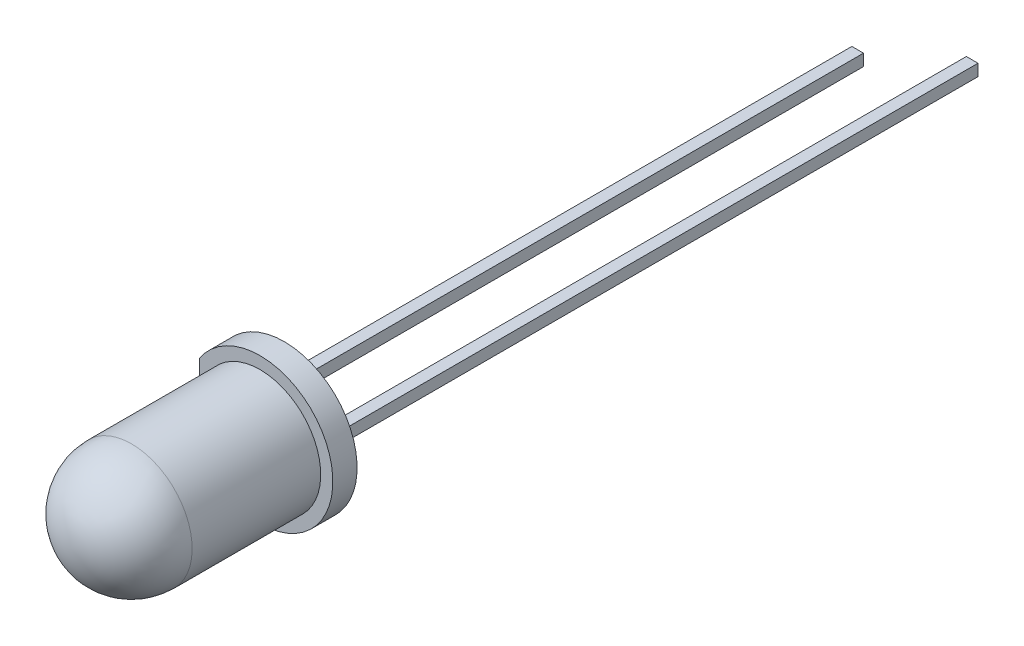
ISO-10303-21;
HEADER;
FILE_DESCRIPTION(('STEP AP214'),'2;1');
FILE_NAME('part.step','',(''),(''),'','','');
FILE_SCHEMA(('AUTOMOTIVE_DESIGN { 1 0 10303 214 1 1 1 1 }'));
ENDSEC;
DATA;
#1=APPLICATION_CONTEXT('core data for automotive mechanical design processes');
#2=APPLICATION_PROTOCOL_DEFINITION('international standard','automotive_design',2000,#1);
#3=PRODUCT_CONTEXT('',#1,'mechanical');
#4=PRODUCT('Part','Part','',(#3));
#5=PRODUCT_RELATED_PRODUCT_CATEGORY('part','',(#4));
#6=PRODUCT_DEFINITION_FORMATION('','',#4);
#7=PRODUCT_DEFINITION_CONTEXT('part definition',#1,'design');
#8=PRODUCT_DEFINITION('design','',#6,#7);
#9=PRODUCT_DEFINITION_SHAPE('','',#8);
#10=(LENGTH_UNIT() NAMED_UNIT(*) SI_UNIT(.MILLI.,.METRE.));
#11=(NAMED_UNIT(*) PLANE_ANGLE_UNIT() SI_UNIT($,.RADIAN.));
#12=(NAMED_UNIT(*) SI_UNIT($,.STERADIAN.) SOLID_ANGLE_UNIT());
#13=UNCERTAINTY_MEASURE_WITH_UNIT(LENGTH_MEASURE(1.E-05),#10,'distance_accuracy_value','');
#14=(GEOMETRIC_REPRESENTATION_CONTEXT(3) GLOBAL_UNCERTAINTY_ASSIGNED_CONTEXT((#13)) GLOBAL_UNIT_ASSIGNED_CONTEXT((#10,
#11,#12)) REPRESENTATION_CONTEXT('',''));
#15=CARTESIAN_POINT('',(0.,0.,0.));
#16=DIRECTION('',(0.,0.,1.));
#17=DIRECTION('',(1.,0.,0.));
#18=AXIS2_PLACEMENT_3D('',#15,#16,#17);
#19=CARTESIAN_POINT('',(-0.0499999999999997,0.,4.26666666666667));
#20=DIRECTION('',(0.,0.,1.));
#21=DIRECTION('',(-1.,0.,0.));
#22=AXIS2_PLACEMENT_3D('',#19,#20,#21);
#23=SPHERICAL_SURFACE('',#22,0.566666666666667);
#24=CARTESIAN_POINT('',(-0.0499999999999997,-0.24,4.26666666666667));
#25=DIRECTION('',(0.,1.,0.));
#26=DIRECTION('',(0.,0.,1.));
#27=AXIS2_PLACEMENT_3D('',#24,#25,#26);
#28=CIRCLE('',#27,0.513333333333333);
#29=CARTESIAN_POINT('',(-0.488634243989226,-0.24,4.));
#30=VERTEX_POINT('',#29);
#31=CARTESIAN_POINT('',(0.388634243989226,-0.24,4.));
#32=VERTEX_POINT('',#31);
#33=EDGE_CURVE('E166',#30,#32,#28,.F.);
#34=ORIENTED_EDGE('',*,*,#33,.T.);
#35=CARTESIAN_POINT('',(-0.0499999999999997,0.,4.));
#36=DIRECTION('',(0.,0.,1.));
#37=DIRECTION('',(1.,0.,0.));
#38=AXIS2_PLACEMENT_3D('',#35,#36,#37);
#39=CIRCLE('',#38,0.5);
#40=EDGE_CURVE('E61',#30,#32,#39,.T.);
#41=ORIENTED_EDGE('',*,*,#40,.F.);
#42=EDGE_LOOP('',(#34,#41));
#43=FACE_BOUND('',#42,.T.);
#44=ADVANCED_FACE('F53',(#43),#23,.T.);
#45=CARTESIAN_POINT('',(0.388634243989226,0.24,4.));
#46=VERTEX_POINT('',#45);
#47=CARTESIAN_POINT('',(-0.488634243989226,0.24,4.));
#48=VERTEX_POINT('',#47);
#49=EDGE_CURVE('E12',#46,#48,#39,.T.);
#50=ORIENTED_EDGE('',*,*,#49,.F.);
#51=CARTESIAN_POINT('',(-0.0499999999999997,0.24,4.26666666666667));
#52=DIRECTION('',(0.,1.,0.));
#53=DIRECTION('',(0.,0.,1.));
#54=AXIS2_PLACEMENT_3D('',#51,#52,#53);
#55=CIRCLE('',#54,0.513333333333333);
#56=EDGE_CURVE('E188',#48,#46,#55,.F.);
#57=ORIENTED_EDGE('',*,*,#56,.F.);
#58=EDGE_LOOP('',(#50,#57));
#59=FACE_BOUND('',#58,.T.);
#60=ADVANCED_FACE('F55',(#59),#23,.T.);
#61=CARTESIAN_POINT('',(-0.55,0.,4.));
#62=DIRECTION('',(0.,0.,-1.));
#63=DIRECTION('',(-1.,0.,0.));
#64=AXIS2_PLACEMENT_3D('',#61,#62,#63);
#65=PLANE('',#64);
#66=CARTESIAN_POINT('',(-0.0499999999999997,0.,4.));
#67=DIRECTION('',(0.,0.,1.));
#68=DIRECTION('',(1.,0.,0.));
#69=AXIS2_PLACEMENT_3D('',#66,#67,#68);
#70=CIRCLE('',#69,0.2);
#71=CARTESIAN_POINT('',(0.15,0.,4.));
#72=VERTEX_POINT('',#71);
#73=EDGE_CURVE('E261',#72,#72,#70,.T.);
#74=ORIENTED_EDGE('',*,*,#73,.F.);
#75=EDGE_LOOP('',(#74));
#76=FACE_BOUND('',#75,.T.);
#77=ORIENTED_EDGE('',*,*,#49,.T.);
#78=DIRECTION('',(1.,0.,0.));
#79=VECTOR('',#78,1.);
#80=CARTESIAN_POINT('',(-1.3,0.24,4.));
#81=LINE('',#80,#79);
#82=CARTESIAN_POINT('',(-1.3,0.24,4.));
#83=VERTEX_POINT('',#82);
#84=EDGE_CURVE('E107',#83,#48,#81,.T.);
#85=ORIENTED_EDGE('',*,*,#84,.F.);
#86=DIRECTION('',(0.,-1.,0.));
#87=VECTOR('',#86,1.);
#88=CARTESIAN_POINT('',(-1.3,0.24,4.));
#89=LINE('',#88,#87);
#90=CARTESIAN_POINT('',(-1.3,-0.24,4.));
#91=VERTEX_POINT('',#90);
#92=EDGE_CURVE('E165',#83,#91,#89,.T.);
#93=ORIENTED_EDGE('',*,*,#92,.T.);
#94=DIRECTION('',(1.,0.,0.));
#95=VECTOR('',#94,1.);
#96=CARTESIAN_POINT('',(-1.3,-0.24,4.));
#97=LINE('',#96,#95);
#98=EDGE_CURVE('E68',#91,#30,#97,.T.);
#99=ORIENTED_EDGE('',*,*,#98,.T.);
#100=ORIENTED_EDGE('',*,*,#40,.T.);
#101=CARTESIAN_POINT('',(1.2,-0.24,4.));
#102=VERTEX_POINT('',#101);
#103=EDGE_CURVE('E151',#32,#102,#97,.T.);
#104=ORIENTED_EDGE('',*,*,#103,.T.);
#105=DIRECTION('',(0.,-1.,0.));
#106=VECTOR('',#105,1.);
#107=CARTESIAN_POINT('',(1.2,0.24,4.));
#108=LINE('',#107,#106);
#109=CARTESIAN_POINT('',(1.2,0.24,4.));
#110=VERTEX_POINT('',#109);
#111=EDGE_CURVE('E135',#110,#102,#108,.T.);
#112=ORIENTED_EDGE('',*,*,#111,.F.);
#113=EDGE_CURVE('E123',#46,#110,#81,.T.);
#114=ORIENTED_EDGE('',*,*,#113,.F.);
#115=EDGE_LOOP('',(#77,#85,#93,#99,#100,#104,#112,#114));
#116=FACE_BOUND('',#115,.T.);
#117=ADVANCED_FACE('F171',(#76,#116),#65,.F.);
#118=CARTESIAN_POINT('',(0.,0.24,0.));
#119=DIRECTION('',(0.,1.,0.));
#120=DIRECTION('',(0.,0.,1.));
#121=AXIS2_PLACEMENT_3D('',#118,#119,#120);
#122=PLANE('',#121);
#123=ORIENTED_EDGE('',*,*,#84,.T.);
#124=ORIENTED_EDGE('',*,*,#56,.T.);
#125=ORIENTED_EDGE('',*,*,#113,.T.);
#126=DIRECTION('',(-0.508148861978286,0.,-0.861269257590315));
#127=VECTOR('',#126,1.);
#128=CARTESIAN_POINT('',(1.2,0.24,4.));
#129=LINE('',#128,#127);
#130=CARTESIAN_POINT('',(0.0199999999999998,0.24,2.));
#131=VERTEX_POINT('',#130);
#132=EDGE_CURVE('E114',#110,#131,#129,.T.);
#133=ORIENTED_EDGE('',*,*,#132,.T.);
#134=DIRECTION('',(-1.,0.,0.));
#135=VECTOR('',#134,1.);
#136=CARTESIAN_POINT('',(0.0199999999999998,0.24,2.));
#137=LINE('',#136,#135);
#138=CARTESIAN_POINT('',(-1.12,0.24,2.));
#139=VERTEX_POINT('',#138);
#140=EDGE_CURVE('E119',#131,#139,#137,.T.);
#141=ORIENTED_EDGE('',*,*,#140,.T.);
#142=DIRECTION('',(0.,0.,-1.));
#143=VECTOR('',#142,1.);
#144=CARTESIAN_POINT('',(-1.12,0.24,2.));
#145=LINE('',#144,#143);
#146=CARTESIAN_POINT('',(-1.12,0.24,-25.));
#147=VERTEX_POINT('',#146);
#148=EDGE_CURVE('E141',#139,#147,#145,.T.);
#149=ORIENTED_EDGE('',*,*,#148,.T.);
#150=DIRECTION('',(1.,0.,0.));
#151=VECTOR('',#150,1.);
#152=CARTESIAN_POINT('',(-1.12,0.24,-25.));
#153=LINE('',#152,#151);
#154=CARTESIAN_POINT('',(-1.6,0.24,-25.));
#155=VERTEX_POINT('',#154);
#156=EDGE_CURVE('E152',#155,#147,#153,.T.);
#157=ORIENTED_EDGE('',*,*,#156,.F.);
#158=DIRECTION('',(0.,0.,1.));
#159=VECTOR('',#158,1.);
#160=CARTESIAN_POINT('',(-1.6,0.24,0.));
#161=LINE('',#160,#159);
#162=CARTESIAN_POINT('',(-1.6,0.24,3.5));
#163=VERTEX_POINT('',#162);
#164=EDGE_CURVE('E77',#155,#163,#161,.T.);
#165=ORIENTED_EDGE('',*,*,#164,.T.);
#166=DIRECTION('',(0.514495755427526,0.,0.857492925712544));
#167=VECTOR('',#166,1.);
#168=CARTESIAN_POINT('',(-1.6,0.24,3.5));
#169=LINE('',#168,#167);
#170=EDGE_CURVE('E161',#163,#83,#169,.T.);
#171=ORIENTED_EDGE('',*,*,#170,.T.);
#172=EDGE_LOOP('',(#123,#124,#125,#133,#141,#149,#157,#165,#171));
#173=FACE_BOUND('',#172,.T.);
#174=ADVANCED_FACE('F116',(#173),#122,.T.);
#175=CARTESIAN_POINT('',(0.,-0.24,0.));
#176=DIRECTION('',(0.,1.,0.));
#177=DIRECTION('',(0.,0.,1.));
#178=AXIS2_PLACEMENT_3D('',#175,#176,#177);
#179=PLANE('',#178);
#180=ORIENTED_EDGE('',*,*,#33,.F.);
#181=ORIENTED_EDGE('',*,*,#98,.F.);
#182=DIRECTION('',(0.514495755427526,0.,0.857492925712544));
#183=VECTOR('',#182,1.);
#184=CARTESIAN_POINT('',(-1.6,-0.24,3.5));
#185=LINE('',#184,#183);
#186=CARTESIAN_POINT('',(-1.6,-0.24,3.5));
#187=VERTEX_POINT('',#186);
#188=EDGE_CURVE('E148',#187,#91,#185,.T.);
#189=ORIENTED_EDGE('',*,*,#188,.F.);
#190=DIRECTION('',(0.,0.,1.));
#191=VECTOR('',#190,1.);
#192=CARTESIAN_POINT('',(-1.6,-0.24,0.));
#193=LINE('',#192,#191);
#194=CARTESIAN_POINT('',(-1.6,-0.24,-25.));
#195=VERTEX_POINT('',#194);
#196=EDGE_CURVE('E101',#195,#187,#193,.T.);
#197=ORIENTED_EDGE('',*,*,#196,.F.);
#198=DIRECTION('',(-1.,0.,0.));
#199=VECTOR('',#198,1.);
#200=CARTESIAN_POINT('',(-1.12,-0.24,-25.));
#201=LINE('',#200,#199);
#202=CARTESIAN_POINT('',(-1.12,-0.24,-25.));
#203=VERTEX_POINT('',#202);
#204=EDGE_CURVE('E209',#203,#195,#201,.T.);
#205=ORIENTED_EDGE('',*,*,#204,.F.);
#206=DIRECTION('',(0.,0.,-1.));
#207=VECTOR('',#206,1.);
#208=CARTESIAN_POINT('',(-1.12,-0.24,2.));
#209=LINE('',#208,#207);
#210=CARTESIAN_POINT('',(-1.12,-0.24,2.));
#211=VERTEX_POINT('',#210);
#212=EDGE_CURVE('E157',#211,#203,#209,.T.);
#213=ORIENTED_EDGE('',*,*,#212,.F.);
#214=DIRECTION('',(-1.,0.,0.));
#215=VECTOR('',#214,1.);
#216=CARTESIAN_POINT('',(0.0199999999999998,-0.24,2.));
#217=LINE('',#216,#215);
#218=CARTESIAN_POINT('',(0.0199999999999998,-0.24,2.));
#219=VERTEX_POINT('',#218);
#220=EDGE_CURVE('E155',#219,#211,#217,.T.);
#221=ORIENTED_EDGE('',*,*,#220,.F.);
#222=DIRECTION('',(-0.508148861978286,0.,-0.861269257590315));
#223=VECTOR('',#222,1.);
#224=CARTESIAN_POINT('',(1.2,-0.24,4.));
#225=LINE('',#224,#223);
#226=EDGE_CURVE('E132',#102,#219,#225,.T.);
#227=ORIENTED_EDGE('',*,*,#226,.F.);
#228=ORIENTED_EDGE('',*,*,#103,.F.);
#229=EDGE_LOOP('',(#180,#181,#189,#197,#205,#213,#221,#227,#228));
#230=FACE_BOUND('',#229,.T.);
#231=ADVANCED_FACE('F223',(#230),#179,.F.);
#232=CARTESIAN_POINT('',(-1.6,0.24,3.5));
#233=DIRECTION('',(0.857492925712544,0.,-0.514495755427526));
#234=DIRECTION('',(-0.514495755427526,0.,-0.857492925712544));
#235=AXIS2_PLACEMENT_3D('',#232,#233,#234);
#236=PLANE('',#235);
#237=ORIENTED_EDGE('',*,*,#188,.T.);
#238=ORIENTED_EDGE('',*,*,#92,.F.);
#239=ORIENTED_EDGE('',*,*,#170,.F.);
#240=DIRECTION('',(0.,-1.,0.));
#241=VECTOR('',#240,1.);
#242=CARTESIAN_POINT('',(-1.6,0.24,3.5));
#243=LINE('',#242,#241);
#244=EDGE_CURVE('E147',#163,#187,#243,.T.);
#245=ORIENTED_EDGE('',*,*,#244,.T.);
#246=EDGE_LOOP('',(#237,#238,#239,#245));
#247=FACE_BOUND('',#246,.T.);
#248=ADVANCED_FACE('F220',(#247),#236,.F.);
#249=CARTESIAN_POINT('',(1.2,0.24,4.));
#250=DIRECTION('',(-0.861269257590315,0.,0.508148861978286));
#251=DIRECTION('',(0.508148861978286,0.,0.861269257590315));
#252=AXIS2_PLACEMENT_3D('',#249,#250,#251);
#253=PLANE('',#252);
#254=ORIENTED_EDGE('',*,*,#226,.T.);
#255=DIRECTION('',(0.,-1.,0.));
#256=VECTOR('',#255,1.);
#257=CARTESIAN_POINT('',(0.0199999999999998,0.24,2.));
#258=LINE('',#257,#256);
#259=EDGE_CURVE('E129',#131,#219,#258,.T.);
#260=ORIENTED_EDGE('',*,*,#259,.F.);
#261=ORIENTED_EDGE('',*,*,#132,.F.);
#262=ORIENTED_EDGE('',*,*,#111,.T.);
#263=EDGE_LOOP('',(#254,#260,#261,#262));
#264=FACE_BOUND('',#263,.T.);
#265=ADVANCED_FACE('F130',(#264),#253,.F.);
#266=CARTESIAN_POINT('',(0.0199999999999998,0.24,2.));
#267=DIRECTION('',(0.,0.,1.));
#268=DIRECTION('',(1.,0.,0.));
#269=AXIS2_PLACEMENT_3D('',#266,#267,#268);
#270=PLANE('',#269);
#271=ORIENTED_EDGE('',*,*,#220,.T.);
#272=DIRECTION('',(0.,-1.,0.));
#273=VECTOR('',#272,1.);
#274=CARTESIAN_POINT('',(-1.12,0.24,2.));
#275=LINE('',#274,#273);
#276=EDGE_CURVE('E136',#139,#211,#275,.T.);
#277=ORIENTED_EDGE('',*,*,#276,.F.);
#278=ORIENTED_EDGE('',*,*,#140,.F.);
#279=ORIENTED_EDGE('',*,*,#259,.T.);
#280=EDGE_LOOP('',(#271,#277,#278,#279));
#281=FACE_BOUND('',#280,.T.);
#282=ADVANCED_FACE('F138',(#281),#270,.F.);
#283=CARTESIAN_POINT('',(-1.12,0.24,2.));
#284=DIRECTION('',(-1.,0.,0.));
#285=DIRECTION('',(0.,0.,1.));
#286=AXIS2_PLACEMENT_3D('',#283,#284,#285);
#287=PLANE('',#286);
#288=ORIENTED_EDGE('',*,*,#212,.T.);
#289=DIRECTION('',(0.,-1.,0.));
#290=VECTOR('',#289,1.);
#291=CARTESIAN_POINT('',(-1.12,-0.24,-25.));
#292=LINE('',#291,#290);
#293=EDGE_CURVE('E203',#147,#203,#292,.T.);
#294=ORIENTED_EDGE('',*,*,#293,.F.);
#295=ORIENTED_EDGE('',*,*,#148,.F.);
#296=ORIENTED_EDGE('',*,*,#276,.T.);
#297=EDGE_LOOP('',(#288,#294,#295,#296));
#298=FACE_BOUND('',#297,.T.);
#299=ADVANCED_FACE('F206',(#298),#287,.F.);
#300=CARTESIAN_POINT('',(-1.6,0.24,0.));
#301=DIRECTION('',(1.,0.,0.));
#302=DIRECTION('',(0.,0.,-1.));
#303=AXIS2_PLACEMENT_3D('',#300,#301,#302);
#304=PLANE('',#303);
#305=ORIENTED_EDGE('',*,*,#196,.T.);
#306=ORIENTED_EDGE('',*,*,#244,.F.);
#307=ORIENTED_EDGE('',*,*,#164,.F.);
#308=DIRECTION('',(0.,1.,0.));
#309=VECTOR('',#308,1.);
#310=CARTESIAN_POINT('',(-1.6,-0.24,-25.));
#311=LINE('',#310,#309);
#312=EDGE_CURVE('E204',#195,#155,#311,.T.);
#313=ORIENTED_EDGE('',*,*,#312,.F.);
#314=EDGE_LOOP('',(#305,#306,#307,#313));
#315=FACE_BOUND('',#314,.T.);
#316=ADVANCED_FACE('F224',(#315),#304,.F.);
#317=CARTESIAN_POINT('',(0.,0.,-25.));
#318=DIRECTION('',(0.,0.,1.));
#319=DIRECTION('',(1.,0.,0.));
#320=AXIS2_PLACEMENT_3D('',#317,#318,#319);
#321=PLANE('',#320);
#322=ORIENTED_EDGE('',*,*,#293,.T.);
#323=ORIENTED_EDGE('',*,*,#204,.T.);
#324=ORIENTED_EDGE('',*,*,#312,.T.);
#325=ORIENTED_EDGE('',*,*,#156,.T.);
#326=EDGE_LOOP('',(#322,#323,#324,#325));
#327=FACE_BOUND('',#326,.T.);
#328=ADVANCED_FACE('F201',(#327),#321,.F.);
#329=CARTESIAN_POINT('',(-0.0499999999999997,0.,3.9));
#330=DIRECTION('',(0.,0.,1.));
#331=DIRECTION('',(1.,0.,0.));
#332=AXIS2_PLACEMENT_3D('',#329,#330,#331);
#333=CYLINDRICAL_SURFACE('',#332,0.2);
#334=CARTESIAN_POINT('',(-0.0499999999999997,0.,3.9));
#335=DIRECTION('',(0.,0.,1.));
#336=DIRECTION('',(1.,0.,0.));
#337=AXIS2_PLACEMENT_3D('',#334,#335,#336);
#338=CIRCLE('',#337,0.2);
#339=CARTESIAN_POINT('',(0.15,0.,3.9));
#340=VERTEX_POINT('',#339);
#341=EDGE_CURVE('E212',#340,#340,#338,.T.);
#342=ORIENTED_EDGE('',*,*,#341,.F.);
#343=EDGE_LOOP('',(#342));
#344=FACE_BOUND('',#343,.T.);
#345=ORIENTED_EDGE('',*,*,#73,.T.);
#346=EDGE_LOOP('',(#345));
#347=FACE_BOUND('',#346,.T.);
#348=ADVANCED_FACE('F231',(#344,#347),#333,.F.);
#349=CARTESIAN_POINT('',(-0.0499999999999997,0.,3.9));
#350=DIRECTION('',(0.,0.,1.));
#351=DIRECTION('',(1.,0.,0.));
#352=AXIS2_PLACEMENT_3D('',#349,#350,#351);
#353=PLANE('',#352);
#354=ORIENTED_EDGE('',*,*,#341,.T.);
#355=EDGE_LOOP('',(#354));
#356=FACE_BOUND('',#355,.T.);
#357=ADVANCED_FACE('F253',(#356),#353,.T.);
#358=CLOSED_SHELL('',(#44,#60,#117,#174,#231,#248,#265,#282,#299,#316,#328,#348,#357));
#359=MANIFOLD_SOLID_BREP('B2',#358);
#360=CARTESIAN_POINT('',(1.12,0.24,2.));
#361=DIRECTION('',(0.,0.,1.));
#362=DIRECTION('',(1.,0.,0.));
#363=AXIS2_PLACEMENT_3D('',#360,#361,#362);
#364=PLANE('',#363);
#365=DIRECTION('',(-1.,0.,0.));
#366=VECTOR('',#365,1.);
#367=CARTESIAN_POINT('',(1.12,-0.24,2.));
#368=LINE('',#367,#366);
#369=CARTESIAN_POINT('',(1.12,-0.24,2.));
#370=VERTEX_POINT('',#369);
#371=CARTESIAN_POINT('',(0.22,-0.24,2.));
#372=VERTEX_POINT('',#371);
#373=EDGE_CURVE('E458',#370,#372,#368,.T.);
#374=ORIENTED_EDGE('',*,*,#373,.T.);
#375=DIRECTION('',(0.,-1.,0.));
#376=VECTOR('',#375,1.);
#377=CARTESIAN_POINT('',(0.22,0.24,2.));
#378=LINE('',#377,#376);
#379=CARTESIAN_POINT('',(0.22,0.24,2.));
#380=VERTEX_POINT('',#379);
#381=EDGE_CURVE('E51',#380,#372,#378,.T.);
#382=ORIENTED_EDGE('',*,*,#381,.F.);
#383=DIRECTION('',(-1.,0.,0.));
#384=VECTOR('',#383,1.);
#385=CARTESIAN_POINT('',(1.12,0.24,2.));
#386=LINE('',#385,#384);
#387=CARTESIAN_POINT('',(1.12,0.24,2.));
#388=VERTEX_POINT('',#387);
#389=EDGE_CURVE('E459',#388,#380,#386,.T.);
#390=ORIENTED_EDGE('',*,*,#389,.F.);
#391=DIRECTION('',(0.,-1.,0.));
#392=VECTOR('',#391,1.);
#393=CARTESIAN_POINT('',(1.12,0.24,2.));
#394=LINE('',#393,#392);
#395=EDGE_CURVE('E464',#388,#370,#394,.T.);
#396=ORIENTED_EDGE('',*,*,#395,.T.);
#397=EDGE_LOOP('',(#374,#382,#390,#396));
#398=FACE_BOUND('',#397,.T.);
#399=ADVANCED_FACE('F372',(#398),#364,.F.);
#400=CARTESIAN_POINT('',(0.22,0.24,2.));
#401=DIRECTION('',(0.861269257590315,0.,-0.508148861978286));
#402=DIRECTION('',(-0.508148861978286,0.,-0.861269257590315));
#403=AXIS2_PLACEMENT_3D('',#400,#401,#402);
#404=PLANE('',#403);
#405=DIRECTION('',(0.508148861978286,0.,0.861269257590315));
#406=VECTOR('',#405,1.);
#407=CARTESIAN_POINT('',(0.22,-0.24,2.));
#408=LINE('',#407,#406);
#409=CARTESIAN_POINT('',(1.4,-0.24,4.));
#410=VERTEX_POINT('',#409);
#411=EDGE_CURVE('E467',#372,#410,#408,.T.);
#412=ORIENTED_EDGE('',*,*,#411,.T.);
#413=DIRECTION('',(0.,-1.,0.));
#414=VECTOR('',#413,1.);
#415=CARTESIAN_POINT('',(1.4,0.24,4.));
#416=LINE('',#415,#414);
#417=CARTESIAN_POINT('',(1.4,0.24,4.));
#418=VERTEX_POINT('',#417);
#419=EDGE_CURVE('E380',#418,#410,#416,.T.);
#420=ORIENTED_EDGE('',*,*,#419,.F.);
#421=DIRECTION('',(0.508148861978286,0.,0.861269257590315));
#422=VECTOR('',#421,1.);
#423=CARTESIAN_POINT('',(0.22,0.24,2.));
#424=LINE('',#423,#422);
#425=EDGE_CURVE('E421',#380,#418,#424,.T.);
#426=ORIENTED_EDGE('',*,*,#425,.F.);
#427=ORIENTED_EDGE('',*,*,#381,.T.);
#428=EDGE_LOOP('',(#412,#420,#426,#427));
#429=FACE_BOUND('',#428,.T.);
#430=ADVANCED_FACE('F482',(#429),#404,.F.);
#431=CARTESIAN_POINT('',(1.4,0.24,4.));
#432=DIRECTION('',(0.,0.,-1.));
#433=DIRECTION('',(-1.,0.,0.));
#434=AXIS2_PLACEMENT_3D('',#431,#432,#433);
#435=PLANE('',#434);
#436=DIRECTION('',(1.,0.,0.));
#437=VECTOR('',#436,1.);
#438=CARTESIAN_POINT('',(1.4,-0.24,4.));
#439=LINE('',#438,#437);
#440=CARTESIAN_POINT('',(1.6,-0.24,4.));
#441=VERTEX_POINT('',#440);
#442=EDGE_CURVE('E407',#410,#441,#439,.T.);
#443=ORIENTED_EDGE('',*,*,#442,.T.);
#444=DIRECTION('',(0.,-1.,0.));
#445=VECTOR('',#444,1.);
#446=CARTESIAN_POINT('',(1.6,0.24,4.));
#447=LINE('',#446,#445);
#448=CARTESIAN_POINT('',(1.6,0.24,4.));
#449=VERTEX_POINT('',#448);
#450=EDGE_CURVE('E473',#449,#441,#447,.T.);
#451=ORIENTED_EDGE('',*,*,#450,.F.);
#452=DIRECTION('',(1.,0.,0.));
#453=VECTOR('',#452,1.);
#454=CARTESIAN_POINT('',(1.4,0.24,4.));
#455=LINE('',#454,#453);
#456=EDGE_CURVE('E438',#418,#449,#455,.T.);
#457=ORIENTED_EDGE('',*,*,#456,.F.);
#458=ORIENTED_EDGE('',*,*,#419,.T.);
#459=EDGE_LOOP('',(#443,#451,#457,#458));
#460=FACE_BOUND('',#459,.T.);
#461=ADVANCED_FACE('F474',(#460),#435,.F.);
#462=CARTESIAN_POINT('',(1.6,0.24,4.));
#463=DIRECTION('',(-1.,0.,0.));
#464=DIRECTION('',(0.,0.,1.));
#465=AXIS2_PLACEMENT_3D('',#462,#463,#464);
#466=PLANE('',#465);
#467=DIRECTION('',(0.,0.,-1.));
#468=VECTOR('',#467,1.);
#469=CARTESIAN_POINT('',(1.6,-0.24,4.));
#470=LINE('',#469,#468);
#471=CARTESIAN_POINT('',(1.6,-0.24,-27.));
#472=VERTEX_POINT('',#471);
#473=EDGE_CURVE('E445',#441,#472,#470,.T.);
#474=ORIENTED_EDGE('',*,*,#473,.T.);
#475=DIRECTION('',(0.,-1.,0.));
#476=VECTOR('',#475,1.);
#477=CARTESIAN_POINT('',(1.6,0.24,-27.));
#478=LINE('',#477,#476);
#479=CARTESIAN_POINT('',(1.6,0.24,-27.));
#480=VERTEX_POINT('',#479);
#481=EDGE_CURVE('E442',#480,#472,#478,.T.);
#482=ORIENTED_EDGE('',*,*,#481,.F.);
#483=DIRECTION('',(0.,0.,-1.));
#484=VECTOR('',#483,1.);
#485=CARTESIAN_POINT('',(1.6,0.24,4.));
#486=LINE('',#485,#484);
#487=EDGE_CURVE('E432',#449,#480,#486,.T.);
#488=ORIENTED_EDGE('',*,*,#487,.F.);
#489=ORIENTED_EDGE('',*,*,#450,.T.);
#490=EDGE_LOOP('',(#474,#482,#488,#489));
#491=FACE_BOUND('',#490,.T.);
#492=ADVANCED_FACE('F443',(#491),#466,.F.);
#493=CARTESIAN_POINT('',(1.12,0.24,0.));
#494=DIRECTION('',(1.,0.,0.));
#495=DIRECTION('',(0.,0.,-1.));
#496=AXIS2_PLACEMENT_3D('',#493,#494,#495);
#497=PLANE('',#496);
#498=DIRECTION('',(0.,0.,1.));
#499=VECTOR('',#498,1.);
#500=CARTESIAN_POINT('',(1.12,-0.24,0.));
#501=LINE('',#500,#499);
#502=CARTESIAN_POINT('',(1.12,-0.24,-27.));
#503=VERTEX_POINT('',#502);
#504=EDGE_CURVE('E414',#503,#370,#501,.T.);
#505=ORIENTED_EDGE('',*,*,#504,.T.);
#506=ORIENTED_EDGE('',*,*,#395,.F.);
#507=DIRECTION('',(0.,0.,1.));
#508=VECTOR('',#507,1.);
#509=CARTESIAN_POINT('',(1.12,0.24,0.));
#510=LINE('',#509,#508);
#511=CARTESIAN_POINT('',(1.12,0.24,-27.));
#512=VERTEX_POINT('',#511);
#513=EDGE_CURVE('E388',#512,#388,#510,.T.);
#514=ORIENTED_EDGE('',*,*,#513,.F.);
#515=DIRECTION('',(0.,1.,0.));
#516=VECTOR('',#515,1.);
#517=CARTESIAN_POINT('',(1.12,-0.24,-27.));
#518=LINE('',#517,#516);
#519=EDGE_CURVE('E453',#503,#512,#518,.T.);
#520=ORIENTED_EDGE('',*,*,#519,.F.);
#521=EDGE_LOOP('',(#505,#506,#514,#520));
#522=FACE_BOUND('',#521,.T.);
#523=ADVANCED_FACE('F478',(#522),#497,.F.);
#524=CARTESIAN_POINT('',(0.,0.24,0.));
#525=DIRECTION('',(0.,-1.,0.));
#526=DIRECTION('',(0.,0.,-1.));
#527=AXIS2_PLACEMENT_3D('',#524,#525,#526);
#528=PLANE('',#527);
#529=ORIENTED_EDGE('',*,*,#389,.T.);
#530=ORIENTED_EDGE('',*,*,#425,.T.);
#531=ORIENTED_EDGE('',*,*,#456,.T.);
#532=ORIENTED_EDGE('',*,*,#487,.T.);
#533=DIRECTION('',(1.,0.,0.));
#534=VECTOR('',#533,1.);
#535=CARTESIAN_POINT('',(1.12,0.24,-27.));
#536=LINE('',#535,#534);
#537=EDGE_CURVE('E436',#512,#480,#536,.T.);
#538=ORIENTED_EDGE('',*,*,#537,.F.);
#539=ORIENTED_EDGE('',*,*,#513,.T.);
#540=EDGE_LOOP('',(#529,#530,#531,#532,#538,#539));
#541=FACE_BOUND('',#540,.T.);
#542=ADVANCED_FACE('F434',(#541),#528,.F.);
#543=CARTESIAN_POINT('',(0.,-0.24,0.));
#544=DIRECTION('',(0.,-1.,0.));
#545=DIRECTION('',(0.,0.,-1.));
#546=AXIS2_PLACEMENT_3D('',#543,#544,#545);
#547=PLANE('',#546);
#548=ORIENTED_EDGE('',*,*,#373,.F.);
#549=ORIENTED_EDGE('',*,*,#504,.F.);
#550=DIRECTION('',(-1.,0.,0.));
#551=VECTOR('',#550,1.);
#552=CARTESIAN_POINT('',(1.6,-0.24,-27.));
#553=LINE('',#552,#551);
#554=EDGE_CURVE('E449',#472,#503,#553,.T.);
#555=ORIENTED_EDGE('',*,*,#554,.F.);
#556=ORIENTED_EDGE('',*,*,#473,.F.);
#557=ORIENTED_EDGE('',*,*,#442,.F.);
#558=ORIENTED_EDGE('',*,*,#411,.F.);
#559=EDGE_LOOP('',(#548,#549,#555,#556,#557,#558));
#560=FACE_BOUND('',#559,.T.);
#561=ADVANCED_FACE('F477',(#560),#547,.T.);
#562=CARTESIAN_POINT('',(0.,0.,-27.));
#563=DIRECTION('',(0.,0.,-1.));
#564=DIRECTION('',(-1.,0.,0.));
#565=AXIS2_PLACEMENT_3D('',#562,#563,#564);
#566=PLANE('',#565);
#567=ORIENTED_EDGE('',*,*,#537,.T.);
#568=ORIENTED_EDGE('',*,*,#481,.T.);
#569=ORIENTED_EDGE('',*,*,#554,.T.);
#570=ORIENTED_EDGE('',*,*,#519,.T.);
#571=EDGE_LOOP('',(#567,#568,#569,#570));
#572=FACE_BOUND('',#571,.T.);
#573=ADVANCED_FACE('F452',(#572),#566,.T.);
#574=CLOSED_SHELL('',(#399,#430,#461,#492,#523,#542,#561,#573));
#575=MANIFOLD_SOLID_BREP('B6',#574);
#576=CARTESIAN_POINT('',(0.,0.,1.));
#577=DIRECTION('',(0.,0.,-1.));
#578=DIRECTION('',(-1.,0.,0.));
#579=AXIS2_PLACEMENT_3D('',#576,#577,#578);
#580=CYLINDRICAL_SURFACE('',#579,3.);
#581=CARTESIAN_POINT('',(0.,0.,1.));
#582=DIRECTION('',(0.,0.,1.));
#583=DIRECTION('',(1.,0.,0.));
#584=AXIS2_PLACEMENT_3D('',#581,#582,#583);
#585=CIRCLE('',#584,3.);
#586=CARTESIAN_POINT('',(-2.5,-1.6583123951777,1.));
#587=VERTEX_POINT('',#586);
#588=CARTESIAN_POINT('',(-2.5,1.6583123951777,1.));
#589=VERTEX_POINT('',#588);
#590=EDGE_CURVE('E583',#587,#589,#585,.T.);
#591=ORIENTED_EDGE('',*,*,#590,.F.);
#592=DIRECTION('',(0.,0.,-1.));
#593=VECTOR('',#592,1.);
#594=CARTESIAN_POINT('',(-2.5,-1.6583123951777,4.35410196624969));
#595=LINE('',#594,#593);
#596=CARTESIAN_POINT('',(-2.5,-1.6583123951777,0.));
#597=VERTEX_POINT('',#596);
#598=EDGE_CURVE('E773',#587,#597,#595,.T.);
#599=ORIENTED_EDGE('',*,*,#598,.T.);
#600=CARTESIAN_POINT('',(0.,0.,0.));
#601=DIRECTION('',(0.,0.,1.));
#602=DIRECTION('',(1.,0.,0.));
#603=AXIS2_PLACEMENT_3D('',#600,#601,#602);
#604=CIRCLE('',#603,3.);
#605=CARTESIAN_POINT('',(-2.5,1.6583123951777,0.));
#606=VERTEX_POINT('',#605);
#607=EDGE_CURVE('E781',#597,#606,#604,.T.);
#608=ORIENTED_EDGE('',*,*,#607,.T.);
#609=DIRECTION('',(0.,0.,-1.));
#610=VECTOR('',#609,1.);
#611=CARTESIAN_POINT('',(-2.5,1.6583123951777,4.35410196624969));
#612=LINE('',#611,#610);
#613=EDGE_CURVE('E776',#589,#606,#612,.T.);
#614=ORIENTED_EDGE('',*,*,#613,.F.);
#615=EDGE_LOOP('',(#591,#599,#608,#614));
#616=FACE_BOUND('',#615,.T.);
#617=ADVANCED_FACE('F576',(#616),#580,.T.);
#618=CARTESIAN_POINT('',(0.,0.,1.));
#619=DIRECTION('',(0.,0.,1.));
#620=DIRECTION('',(1.,0.,0.));
#621=AXIS2_PLACEMENT_3D('',#618,#619,#620);
#622=PLANE('',#621);
#623=DIRECTION('',(0.,-1.,0.));
#624=VECTOR('',#623,1.);
#625=CARTESIAN_POINT('',(-2.5,1.6583123951777,1.));
#626=LINE('',#625,#624);
#627=CARTESIAN_POINT('',(-2.5,0.,1.));
#628=VERTEX_POINT('',#627);
#629=EDGE_CURVE('E768',#628,#587,#626,.T.);
#630=ORIENTED_EDGE('',*,*,#629,.T.);
#631=ORIENTED_EDGE('',*,*,#590,.T.);
#632=EDGE_CURVE('E770',#589,#628,#626,.T.);
#633=ORIENTED_EDGE('',*,*,#632,.T.);
#634=CARTESIAN_POINT('',(0.,0.,1.));
#635=DIRECTION('',(0.,0.,1.));
#636=DIRECTION('',(1.,0.,0.));
#637=AXIS2_PLACEMENT_3D('',#634,#635,#636);
#638=CIRCLE('',#637,2.5);
#639=EDGE_CURVE('E370',#628,#628,#638,.T.);
#640=ORIENTED_EDGE('',*,*,#639,.F.);
#641=EDGE_LOOP('',(#630,#631,#633,#640));
#642=FACE_BOUND('',#641,.T.);
#643=ADVANCED_FACE('F795',(#642),#622,.T.);
#644=CARTESIAN_POINT('',(0.,0.,0.));
#645=DIRECTION('',(0.,0.,1.));
#646=DIRECTION('',(1.,0.,0.));
#647=AXIS2_PLACEMENT_3D('',#644,#645,#646);
#648=PLANE('',#647);
#649=DIRECTION('',(0.,1.,0.));
#650=VECTOR('',#649,1.);
#651=CARTESIAN_POINT('',(-1.6,-0.24,0.));
#652=LINE('',#651,#650);
#653=CARTESIAN_POINT('',(-1.6,-0.24,0.));
#654=VERTEX_POINT('',#653);
#655=CARTESIAN_POINT('',(-1.6,0.24,0.));
#656=VERTEX_POINT('',#655);
#657=EDGE_CURVE('E690',#654,#656,#652,.T.);
#658=ORIENTED_EDGE('',*,*,#657,.F.);
#659=DIRECTION('',(-1.,0.,0.));
#660=VECTOR('',#659,1.);
#661=CARTESIAN_POINT('',(-1.6,-0.24,0.));
#662=LINE('',#661,#660);
#663=CARTESIAN_POINT('',(-1.12,-0.24,0.));
#664=VERTEX_POINT('',#663);
#665=EDGE_CURVE('E697',#664,#654,#662,.T.);
#666=ORIENTED_EDGE('',*,*,#665,.F.);
#667=DIRECTION('',(0.,1.,0.));
#668=VECTOR('',#667,1.);
#669=CARTESIAN_POINT('',(-1.12,-0.24,0.));
#670=LINE('',#669,#668);
#671=CARTESIAN_POINT('',(-1.12,0.24,0.));
#672=VERTEX_POINT('',#671);
#673=EDGE_CURVE('E769',#664,#672,#670,.T.);
#674=ORIENTED_EDGE('',*,*,#673,.T.);
#675=DIRECTION('',(-1.,0.,0.));
#676=VECTOR('',#675,1.);
#677=CARTESIAN_POINT('',(-1.6,0.24,0.));
#678=LINE('',#677,#676);
#679=EDGE_CURVE('E711',#672,#656,#678,.T.);
#680=ORIENTED_EDGE('',*,*,#679,.T.);
#681=EDGE_LOOP('',(#658,#666,#674,#680));
#682=FACE_BOUND('',#681,.T.);
#683=DIRECTION('',(0.,1.,0.));
#684=VECTOR('',#683,1.);
#685=CARTESIAN_POINT('',(1.12,-0.24,0.));
#686=LINE('',#685,#684);
#687=CARTESIAN_POINT('',(1.12,-0.24,0.));
#688=VERTEX_POINT('',#687);
#689=CARTESIAN_POINT('',(1.12,0.24,0.));
#690=VERTEX_POINT('',#689);
#691=EDGE_CURVE('E738',#688,#690,#686,.T.);
#692=ORIENTED_EDGE('',*,*,#691,.F.);
#693=DIRECTION('',(-1.,0.,0.));
#694=VECTOR('',#693,1.);
#695=CARTESIAN_POINT('',(1.12,-0.24,0.));
#696=LINE('',#695,#694);
#697=CARTESIAN_POINT('',(1.6,-0.24,0.));
#698=VERTEX_POINT('',#697);
#699=EDGE_CURVE('E719',#698,#688,#696,.T.);
#700=ORIENTED_EDGE('',*,*,#699,.F.);
#701=DIRECTION('',(0.,1.,0.));
#702=VECTOR('',#701,1.);
#703=CARTESIAN_POINT('',(1.6,-0.24,0.));
#704=LINE('',#703,#702);
#705=CARTESIAN_POINT('',(1.6,0.24,0.));
#706=VERTEX_POINT('',#705);
#707=EDGE_CURVE('E754',#698,#706,#704,.T.);
#708=ORIENTED_EDGE('',*,*,#707,.T.);
#709=DIRECTION('',(-1.,0.,0.));
#710=VECTOR('',#709,1.);
#711=CARTESIAN_POINT('',(1.12,0.24,0.));
#712=LINE('',#711,#710);
#713=EDGE_CURVE('E739',#706,#690,#712,.T.);
#714=ORIENTED_EDGE('',*,*,#713,.T.);
#715=EDGE_LOOP('',(#692,#700,#708,#714));
#716=FACE_BOUND('',#715,.T.);
#717=ORIENTED_EDGE('',*,*,#607,.F.);
#718=DIRECTION('',(0.,-1.,0.));
#719=VECTOR('',#718,1.);
#720=CARTESIAN_POINT('',(-2.5,1.6583123951777,0.));
#721=LINE('',#720,#719);
#722=EDGE_CURVE('E766',#606,#597,#721,.T.);
#723=ORIENTED_EDGE('',*,*,#722,.F.);
#724=EDGE_LOOP('',(#717,#723));
#725=FACE_BOUND('',#724,.T.);
#726=ADVANCED_FACE('F709',(#682,#716,#725),#648,.F.);
#727=CARTESIAN_POINT('',(0.,0.,6.3));
#728=DIRECTION('',(0.,0.,-1.));
#729=DIRECTION('',(0.,1.,0.));
#730=AXIS2_PLACEMENT_3D('',#727,#728,#729);
#731=SPHERICAL_SURFACE('',#730,2.5);
#732=CARTESIAN_POINT('',(0.,0.,6.3));
#733=DIRECTION('',(0.,0.,-1.));
#734=DIRECTION('',(0.,1.,0.));
#735=AXIS2_PLACEMENT_3D('',#732,#733,#734);
#736=CIRCLE('',#735,2.5);
#737=CARTESIAN_POINT('',(0.,2.5,6.3));
#738=VERTEX_POINT('',#737);
#739=EDGE_CURVE('E778',#738,#738,#736,.T.);
#740=ORIENTED_EDGE('',*,*,#739,.F.);
#741=EDGE_LOOP('',(#740));
#742=FACE_BOUND('',#741,.T.);
#743=ADVANCED_FACE('F799',(#742),#731,.T.);
#744=CARTESIAN_POINT('',(0.,0.,1.));
#745=DIRECTION('',(0.,0.,-1.));
#746=DIRECTION('',(0.,1.,0.));
#747=AXIS2_PLACEMENT_3D('',#744,#745,#746);
#748=CYLINDRICAL_SURFACE('',#747,2.5);
#749=ORIENTED_EDGE('',*,*,#739,.T.);
#750=EDGE_LOOP('',(#749));
#751=FACE_BOUND('',#750,.T.);
#752=ORIENTED_EDGE('',*,*,#639,.T.);
#753=EDGE_LOOP('',(#752));
#754=FACE_BOUND('',#753,.T.);
#755=ADVANCED_FACE('F797',(#751,#754),#748,.T.);
#756=CARTESIAN_POINT('',(-2.5,1.6583123951777,4.35410196624969));
#757=DIRECTION('',(1.,0.,0.));
#758=DIRECTION('',(0.,0.,-1.));
#759=AXIS2_PLACEMENT_3D('',#756,#757,#758);
#760=PLANE('',#759);
#761=ORIENTED_EDGE('',*,*,#613,.T.);
#762=ORIENTED_EDGE('',*,*,#722,.T.);
#763=ORIENTED_EDGE('',*,*,#598,.F.);
#764=ORIENTED_EDGE('',*,*,#629,.F.);
#765=ORIENTED_EDGE('',*,*,#632,.F.);
#766=EDGE_LOOP('',(#761,#762,#763,#764,#765));
#767=FACE_BOUND('',#766,.T.);
#768=ADVANCED_FACE('F791',(#767),#760,.F.);
#769=CARTESIAN_POINT('',(1.6,-0.24,0.));
#770=DIRECTION('',(1.,0.,0.));
#771=DIRECTION('',(0.,0.,-1.));
#772=AXIS2_PLACEMENT_3D('',#769,#770,#771);
#773=PLANE('',#772);
#774=DIRECTION('',(0.,0.,-1.));
#775=VECTOR('',#774,1.);
#776=CARTESIAN_POINT('',(1.6,0.24,0.));
#777=LINE('',#776,#775);
#778=CARTESIAN_POINT('',(1.6,0.24,4.));
#779=VERTEX_POINT('',#778);
#780=EDGE_CURVE('E723',#779,#706,#777,.T.);
#781=ORIENTED_EDGE('',*,*,#780,.T.);
#782=ORIENTED_EDGE('',*,*,#707,.F.);
#783=DIRECTION('',(0.,0.,-1.));
#784=VECTOR('',#783,1.);
#785=CARTESIAN_POINT('',(1.6,-0.24,0.));
#786=LINE('',#785,#784);
#787=CARTESIAN_POINT('',(1.6,-0.24,4.));
#788=VERTEX_POINT('',#787);
#789=EDGE_CURVE('E735',#788,#698,#786,.T.);
#790=ORIENTED_EDGE('',*,*,#789,.F.);
#791=DIRECTION('',(0.,1.,0.));
#792=VECTOR('',#791,1.);
#793=CARTESIAN_POINT('',(1.6,-0.24,4.));
#794=LINE('',#793,#792);
#795=EDGE_CURVE('E757',#788,#779,#794,.T.);
#796=ORIENTED_EDGE('',*,*,#795,.T.);
#797=EDGE_LOOP('',(#781,#782,#790,#796));
#798=FACE_BOUND('',#797,.T.);
#799=ADVANCED_FACE('F806',(#798),#773,.F.);
#800=CARTESIAN_POINT('',(1.6,-0.24,4.));
#801=DIRECTION('',(0.,0.,1.));
#802=DIRECTION('',(1.,0.,0.));
#803=AXIS2_PLACEMENT_3D('',#800,#801,#802);
#804=PLANE('',#803);
#805=DIRECTION('',(1.,0.,0.));
#806=VECTOR('',#805,1.);
#807=CARTESIAN_POINT('',(1.6,0.24,4.));
#808=LINE('',#807,#806);
#809=CARTESIAN_POINT('',(1.4,0.24,4.));
#810=VERTEX_POINT('',#809);
#811=EDGE_CURVE('E749',#810,#779,#808,.T.);
#812=ORIENTED_EDGE('',*,*,#811,.T.);
#813=ORIENTED_EDGE('',*,*,#795,.F.);
#814=DIRECTION('',(1.,0.,0.));
#815=VECTOR('',#814,1.);
#816=CARTESIAN_POINT('',(1.6,-0.24,4.));
#817=LINE('',#816,#815);
#818=CARTESIAN_POINT('',(1.4,-0.24,4.));
#819=VERTEX_POINT('',#818);
#820=EDGE_CURVE('E732',#819,#788,#817,.T.);
#821=ORIENTED_EDGE('',*,*,#820,.F.);
#822=DIRECTION('',(0.,1.,0.));
#823=VECTOR('',#822,1.);
#824=CARTESIAN_POINT('',(1.4,-0.24,4.));
#825=LINE('',#824,#823);
#826=EDGE_CURVE('E759',#819,#810,#825,.T.);
#827=ORIENTED_EDGE('',*,*,#826,.T.);
#828=EDGE_LOOP('',(#812,#813,#821,#827));
#829=FACE_BOUND('',#828,.T.);
#830=ADVANCED_FACE('F851',(#829),#804,.F.);
#831=CARTESIAN_POINT('',(1.4,-0.24,4.));
#832=DIRECTION('',(-0.861269257590315,0.,0.508148861978286));
#833=DIRECTION('',(0.508148861978286,0.,0.861269257590315));
#834=AXIS2_PLACEMENT_3D('',#831,#832,#833);
#835=PLANE('',#834);
#836=DIRECTION('',(0.508148861978286,0.,0.861269257590315));
#837=VECTOR('',#836,1.);
#838=CARTESIAN_POINT('',(1.4,0.24,4.));
#839=LINE('',#838,#837);
#840=CARTESIAN_POINT('',(0.22,0.24,2.));
#841=VERTEX_POINT('',#840);
#842=EDGE_CURVE('E746',#841,#810,#839,.T.);
#843=ORIENTED_EDGE('',*,*,#842,.T.);
#844=ORIENTED_EDGE('',*,*,#826,.F.);
#845=DIRECTION('',(0.508148861978286,0.,0.861269257590315));
#846=VECTOR('',#845,1.);
#847=CARTESIAN_POINT('',(1.4,-0.24,4.));
#848=LINE('',#847,#846);
#849=CARTESIAN_POINT('',(0.22,-0.24,2.));
#850=VERTEX_POINT('',#849);
#851=EDGE_CURVE('E729',#850,#819,#848,.T.);
#852=ORIENTED_EDGE('',*,*,#851,.F.);
#853=DIRECTION('',(0.,1.,0.));
#854=VECTOR('',#853,1.);
#855=CARTESIAN_POINT('',(0.22,-0.24,2.));
#856=LINE('',#855,#854);
#857=EDGE_CURVE('E761',#850,#841,#856,.T.);
#858=ORIENTED_EDGE('',*,*,#857,.T.);
#859=EDGE_LOOP('',(#843,#844,#852,#858));
#860=FACE_BOUND('',#859,.T.);
#861=ADVANCED_FACE('F858',(#860),#835,.F.);
#862=CARTESIAN_POINT('',(0.22,-0.24,2.));
#863=DIRECTION('',(0.,0.,-1.));
#864=DIRECTION('',(-1.,0.,0.));
#865=AXIS2_PLACEMENT_3D('',#862,#863,#864);
#866=PLANE('',#865);
#867=DIRECTION('',(-1.,0.,0.));
#868=VECTOR('',#867,1.);
#869=CARTESIAN_POINT('',(0.22,0.24,2.));
#870=LINE('',#869,#868);
#871=CARTESIAN_POINT('',(1.12,0.24,2.));
#872=VERTEX_POINT('',#871);
#873=EDGE_CURVE('E743',#872,#841,#870,.T.);
#874=ORIENTED_EDGE('',*,*,#873,.T.);
#875=ORIENTED_EDGE('',*,*,#857,.F.);
#876=DIRECTION('',(-1.,0.,0.));
#877=VECTOR('',#876,1.);
#878=CARTESIAN_POINT('',(0.22,-0.24,2.));
#879=LINE('',#878,#877);
#880=CARTESIAN_POINT('',(1.12,-0.24,2.));
#881=VERTEX_POINT('',#880);
#882=EDGE_CURVE('E726',#881,#850,#879,.T.);
#883=ORIENTED_EDGE('',*,*,#882,.F.);
#884=DIRECTION('',(0.,1.,0.));
#885=VECTOR('',#884,1.);
#886=CARTESIAN_POINT('',(1.12,-0.24,2.));
#887=LINE('',#886,#885);
#888=EDGE_CURVE('E763',#881,#872,#887,.T.);
#889=ORIENTED_EDGE('',*,*,#888,.T.);
#890=EDGE_LOOP('',(#874,#875,#883,#889));
#891=FACE_BOUND('',#890,.T.);
#892=ADVANCED_FACE('F866',(#891),#866,.F.);
#893=CARTESIAN_POINT('',(1.12,-0.24,2.));
#894=DIRECTION('',(-1.,0.,0.));
#895=DIRECTION('',(0.,0.,1.));
#896=AXIS2_PLACEMENT_3D('',#893,#894,#895);
#897=PLANE('',#896);
#898=DIRECTION('',(0.,0.,1.));
#899=VECTOR('',#898,1.);
#900=CARTESIAN_POINT('',(1.12,0.24,2.));
#901=LINE('',#900,#899);
#902=EDGE_CURVE('E598',#690,#872,#901,.T.);
#903=ORIENTED_EDGE('',*,*,#902,.T.);
#904=ORIENTED_EDGE('',*,*,#888,.F.);
#905=DIRECTION('',(0.,0.,1.));
#906=VECTOR('',#905,1.);
#907=CARTESIAN_POINT('',(1.12,-0.24,2.));
#908=LINE('',#907,#906);
#909=EDGE_CURVE('E722',#688,#881,#908,.T.);
#910=ORIENTED_EDGE('',*,*,#909,.F.);
#911=ORIENTED_EDGE('',*,*,#691,.T.);
#912=EDGE_LOOP('',(#903,#904,#910,#911));
#913=FACE_BOUND('',#912,.T.);
#914=ADVANCED_FACE('F874',(#913),#897,.F.);
#915=CARTESIAN_POINT('',(0.,-0.24,0.));
#916=DIRECTION('',(0.,-1.,0.));
#917=DIRECTION('',(0.,0.,-1.));
#918=AXIS2_PLACEMENT_3D('',#915,#916,#917);
#919=PLANE('',#918);
#920=ORIENTED_EDGE('',*,*,#699,.T.);
#921=ORIENTED_EDGE('',*,*,#909,.T.);
#922=ORIENTED_EDGE('',*,*,#882,.T.);
#923=ORIENTED_EDGE('',*,*,#851,.T.);
#924=ORIENTED_EDGE('',*,*,#820,.T.);
#925=ORIENTED_EDGE('',*,*,#789,.T.);
#926=EDGE_LOOP('',(#920,#921,#922,#923,#924,#925));
#927=FACE_BOUND('',#926,.T.);
#928=ADVANCED_FACE('F882',(#927),#919,.F.);
#929=CARTESIAN_POINT('',(0.,0.24,0.));
#930=DIRECTION('',(0.,-1.,0.));
#931=DIRECTION('',(0.,0.,-1.));
#932=AXIS2_PLACEMENT_3D('',#929,#930,#931);
#933=PLANE('',#932);
#934=ORIENTED_EDGE('',*,*,#713,.F.);
#935=ORIENTED_EDGE('',*,*,#780,.F.);
#936=ORIENTED_EDGE('',*,*,#811,.F.);
#937=ORIENTED_EDGE('',*,*,#842,.F.);
#938=ORIENTED_EDGE('',*,*,#873,.F.);
#939=ORIENTED_EDGE('',*,*,#902,.F.);
#940=EDGE_LOOP('',(#934,#935,#936,#937,#938,#939));
#941=FACE_BOUND('',#940,.T.);
#942=ADVANCED_FACE('F890',(#941),#933,.T.);
#943=CARTESIAN_POINT('',(-1.12,-0.24,0.));
#944=DIRECTION('',(1.,0.,0.));
#945=DIRECTION('',(0.,0.,-1.));
#946=AXIS2_PLACEMENT_3D('',#943,#944,#945);
#947=PLANE('',#946);
#948=DIRECTION('',(0.,0.,-1.));
#949=VECTOR('',#948,1.);
#950=CARTESIAN_POINT('',(-1.12,0.24,0.));
#951=LINE('',#950,#949);
#952=CARTESIAN_POINT('',(-1.12,0.24,2.));
#953=VERTEX_POINT('',#952);
#954=EDGE_CURVE('E707',#953,#672,#951,.T.);
#955=ORIENTED_EDGE('',*,*,#954,.T.);
#956=ORIENTED_EDGE('',*,*,#673,.F.);
#957=DIRECTION('',(0.,0.,-1.));
#958=VECTOR('',#957,1.);
#959=CARTESIAN_POINT('',(-1.12,-0.24,0.));
#960=LINE('',#959,#958);
#961=CARTESIAN_POINT('',(-1.12,-0.24,2.));
#962=VERTEX_POINT('',#961);
#963=EDGE_CURVE('E704',#962,#664,#960,.T.);
#964=ORIENTED_EDGE('',*,*,#963,.F.);
#965=DIRECTION('',(0.,1.,0.));
#966=VECTOR('',#965,1.);
#967=CARTESIAN_POINT('',(-1.12,-0.24,2.));
#968=LINE('',#967,#966);
#969=EDGE_CURVE('E993',#962,#953,#968,.T.);
#970=ORIENTED_EDGE('',*,*,#969,.T.);
#971=EDGE_LOOP('',(#955,#956,#964,#970));
#972=FACE_BOUND('',#971,.T.);
#973=ADVANCED_FACE('F898',(#972),#947,.F.);
#974=CARTESIAN_POINT('',(-1.12,-0.24,2.));
#975=DIRECTION('',(0.,0.,-1.));
#976=DIRECTION('',(-1.,0.,0.));
#977=AXIS2_PLACEMENT_3D('',#974,#975,#976);
#978=PLANE('',#977);
#979=DIRECTION('',(-1.,0.,0.));
#980=VECTOR('',#979,1.);
#981=CARTESIAN_POINT('',(-1.12,0.24,2.));
#982=LINE('',#981,#980);
#983=CARTESIAN_POINT('',(0.0199999999999998,0.24,2.));
#984=VERTEX_POINT('',#983);
#985=EDGE_CURVE('E995',#984,#953,#982,.T.);
#986=ORIENTED_EDGE('',*,*,#985,.T.);
#987=ORIENTED_EDGE('',*,*,#969,.F.);
#988=DIRECTION('',(-1.,0.,0.));
#989=VECTOR('',#988,1.);
#990=CARTESIAN_POINT('',(-1.12,-0.24,2.));
#991=LINE('',#990,#989);
#992=CARTESIAN_POINT('',(0.0199999999999998,-0.24,2.));
#993=VERTEX_POINT('',#992);
#994=EDGE_CURVE('E715',#993,#962,#991,.T.);
#995=ORIENTED_EDGE('',*,*,#994,.F.);
#996=DIRECTION('',(0.,1.,0.));
#997=VECTOR('',#996,1.);
#998=CARTESIAN_POINT('',(0.0199999999999998,-0.24,2.));
#999=LINE('',#998,#997);
#1000=EDGE_CURVE('E998',#993,#984,#999,.T.);
#1001=ORIENTED_EDGE('',*,*,#1000,.T.);
#1002=EDGE_LOOP('',(#986,#987,#995,#1001));
#1003=FACE_BOUND('',#1002,.T.);
#1004=ADVANCED_FACE('F905',(#1003),#978,.F.);
#1005=CARTESIAN_POINT('',(0.0199999999999998,-0.24,2.));
#1006=DIRECTION('',(0.861269257590315,0.,-0.508148861978286));
#1007=DIRECTION('',(-0.508148861978286,0.,-0.861269257590315));
#1008=AXIS2_PLACEMENT_3D('',#1005,#1006,#1007);
#1009=PLANE('',#1008);
#1010=DIRECTION('',(-0.508148861978286,0.,-0.861269257590315));
#1011=VECTOR('',#1010,1.);
#1012=CARTESIAN_POINT('',(0.0199999999999998,0.24,2.));
#1013=LINE('',#1012,#1011);
#1014=CARTESIAN_POINT('',(1.2,0.24,4.));
#1015=VERTEX_POINT('',#1014);
#1016=EDGE_CURVE('E1014',#1015,#984,#1013,.T.);
#1017=ORIENTED_EDGE('',*,*,#1016,.T.);
#1018=ORIENTED_EDGE('',*,*,#1000,.F.);
#1019=DIRECTION('',(-0.508148861978286,0.,-0.861269257590315));
#1020=VECTOR('',#1019,1.);
#1021=CARTESIAN_POINT('',(0.0199999999999998,-0.24,2.));
#1022=LINE('',#1021,#1020);
#1023=CARTESIAN_POINT('',(1.2,-0.24,4.));
#1024=VERTEX_POINT('',#1023);
#1025=EDGE_CURVE('E1022',#1024,#993,#1022,.T.);
#1026=ORIENTED_EDGE('',*,*,#1025,.F.);
#1027=DIRECTION('',(0.,1.,0.));
#1028=VECTOR('',#1027,1.);
#1029=CARTESIAN_POINT('',(1.2,-0.24,4.));
#1030=LINE('',#1029,#1028);
#1031=EDGE_CURVE('E1003',#1024,#1015,#1030,.T.);
#1032=ORIENTED_EDGE('',*,*,#1031,.T.);
#1033=EDGE_LOOP('',(#1017,#1018,#1026,#1032));
#1034=FACE_BOUND('',#1033,.T.);
#1035=ADVANCED_FACE('F913',(#1034),#1009,.F.);
#1036=CARTESIAN_POINT('',(1.2,-0.24,4.));
#1037=DIRECTION('',(0.,0.,1.));
#1038=DIRECTION('',(1.,0.,0.));
#1039=AXIS2_PLACEMENT_3D('',#1036,#1037,#1038);
#1040=PLANE('',#1039);
#1041=DIRECTION('',(1.,0.,0.));
#1042=VECTOR('',#1041,1.);
#1043=CARTESIAN_POINT('',(1.2,0.24,4.));
#1044=LINE('',#1043,#1042);
#1045=CARTESIAN_POINT('',(-1.3,0.24,4.));
#1046=VERTEX_POINT('',#1045);
#1047=EDGE_CURVE('E1007',#1046,#1015,#1044,.T.);
#1048=ORIENTED_EDGE('',*,*,#1047,.T.);
#1049=ORIENTED_EDGE('',*,*,#1031,.F.);
#1050=DIRECTION('',(1.,0.,0.));
#1051=VECTOR('',#1050,1.);
#1052=CARTESIAN_POINT('',(1.2,-0.24,4.));
#1053=LINE('',#1052,#1051);
#1054=CARTESIAN_POINT('',(-1.3,-0.24,4.));
#1055=VERTEX_POINT('',#1054);
#1056=EDGE_CURVE('E1009',#1055,#1024,#1053,.T.);
#1057=ORIENTED_EDGE('',*,*,#1056,.F.);
#1058=DIRECTION('',(0.,1.,0.));
#1059=VECTOR('',#1058,1.);
#1060=CARTESIAN_POINT('',(-1.3,-0.24,4.));
#1061=LINE('',#1060,#1059);
#1062=EDGE_CURVE('E713',#1055,#1046,#1061,.T.);
#1063=ORIENTED_EDGE('',*,*,#1062,.T.);
#1064=EDGE_LOOP('',(#1048,#1049,#1057,#1063));
#1065=FACE_BOUND('',#1064,.T.);
#1066=ADVANCED_FACE('F921',(#1065),#1040,.F.);
#1067=CARTESIAN_POINT('',(-1.3,-0.24,4.));
#1068=DIRECTION('',(-0.857492925712544,0.,0.514495755427526));
#1069=DIRECTION('',(0.514495755427526,0.,0.857492925712544));
#1070=AXIS2_PLACEMENT_3D('',#1067,#1068,#1069);
#1071=PLANE('',#1070);
#1072=DIRECTION('',(0.514495755427526,0.,0.857492925712544));
#1073=VECTOR('',#1072,1.);
#1074=CARTESIAN_POINT('',(-1.3,0.24,4.));
#1075=LINE('',#1074,#1073);
#1076=CARTESIAN_POINT('',(-1.6,0.24,3.5));
#1077=VERTEX_POINT('',#1076);
#1078=EDGE_CURVE('E1012',#1077,#1046,#1075,.T.);
#1079=ORIENTED_EDGE('',*,*,#1078,.T.);
#1080=ORIENTED_EDGE('',*,*,#1062,.F.);
#1081=DIRECTION('',(0.514495755427526,0.,0.857492925712544));
#1082=VECTOR('',#1081,1.);
#1083=CARTESIAN_POINT('',(-1.3,-0.24,4.));
#1084=LINE('',#1083,#1082);
#1085=CARTESIAN_POINT('',(-1.6,-0.24,3.5));
#1086=VERTEX_POINT('',#1085);
#1087=EDGE_CURVE('E696',#1086,#1055,#1084,.T.);
#1088=ORIENTED_EDGE('',*,*,#1087,.F.);
#1089=DIRECTION('',(0.,1.,0.));
#1090=VECTOR('',#1089,1.);
#1091=CARTESIAN_POINT('',(-1.6,-0.24,3.5));
#1092=LINE('',#1091,#1090);
#1093=EDGE_CURVE('E692',#1086,#1077,#1092,.T.);
#1094=ORIENTED_EDGE('',*,*,#1093,.T.);
#1095=EDGE_LOOP('',(#1079,#1080,#1088,#1094));
#1096=FACE_BOUND('',#1095,.T.);
#1097=ADVANCED_FACE('F929',(#1096),#1071,.F.);
#1098=CARTESIAN_POINT('',(-1.6,-0.24,0.));
#1099=DIRECTION('',(-1.,0.,0.));
#1100=DIRECTION('',(0.,0.,1.));
#1101=AXIS2_PLACEMENT_3D('',#1098,#1099,#1100);
#1102=PLANE('',#1101);
#1103=DIRECTION('',(0.,0.,1.));
#1104=VECTOR('',#1103,1.);
#1105=CARTESIAN_POINT('',(-1.6,0.24,0.));
#1106=LINE('',#1105,#1104);
#1107=EDGE_CURVE('E590',#656,#1077,#1106,.T.);
#1108=ORIENTED_EDGE('',*,*,#1107,.T.);
#1109=ORIENTED_EDGE('',*,*,#1093,.F.);
#1110=DIRECTION('',(0.,0.,1.));
#1111=VECTOR('',#1110,1.);
#1112=CARTESIAN_POINT('',(-1.6,-0.24,0.));
#1113=LINE('',#1112,#1111);
#1114=EDGE_CURVE('E686',#654,#1086,#1113,.T.);
#1115=ORIENTED_EDGE('',*,*,#1114,.F.);
#1116=ORIENTED_EDGE('',*,*,#657,.T.);
#1117=EDGE_LOOP('',(#1108,#1109,#1115,#1116));
#1118=FACE_BOUND('',#1117,.T.);
#1119=ADVANCED_FACE('F688',(#1118),#1102,.F.);
#1120=CARTESIAN_POINT('',(0.,-0.24,0.));
#1121=DIRECTION('',(0.,-1.,0.));
#1122=DIRECTION('',(0.,0.,-1.));
#1123=AXIS2_PLACEMENT_3D('',#1120,#1121,#1122);
#1124=PLANE('',#1123);
#1125=ORIENTED_EDGE('',*,*,#665,.T.);
#1126=ORIENTED_EDGE('',*,*,#1114,.T.);
#1127=ORIENTED_EDGE('',*,*,#1087,.T.);
#1128=ORIENTED_EDGE('',*,*,#1056,.T.);
#1129=ORIENTED_EDGE('',*,*,#1025,.T.);
#1130=ORIENTED_EDGE('',*,*,#994,.T.);
#1131=ORIENTED_EDGE('',*,*,#963,.T.);
#1132=EDGE_LOOP('',(#1125,#1126,#1127,#1128,#1129,#1130,#1131));
#1133=FACE_BOUND('',#1132,.T.);
#1134=ADVANCED_FACE('F701',(#1133),#1124,.F.);
#1135=CARTESIAN_POINT('',(0.,0.24,0.));
#1136=DIRECTION('',(0.,-1.,0.));
#1137=DIRECTION('',(0.,0.,-1.));
#1138=AXIS2_PLACEMENT_3D('',#1135,#1136,#1137);
#1139=PLANE('',#1138);
#1140=ORIENTED_EDGE('',*,*,#679,.F.);
#1141=ORIENTED_EDGE('',*,*,#954,.F.);
#1142=ORIENTED_EDGE('',*,*,#985,.F.);
#1143=ORIENTED_EDGE('',*,*,#1016,.F.);
#1144=ORIENTED_EDGE('',*,*,#1047,.F.);
#1145=ORIENTED_EDGE('',*,*,#1078,.F.);
#1146=ORIENTED_EDGE('',*,*,#1107,.F.);
#1147=EDGE_LOOP('',(#1140,#1141,#1142,#1143,#1144,#1145,#1146));
#1148=FACE_BOUND('',#1147,.T.);
#1149=ADVANCED_FACE('F950',(#1148),#1139,.T.);
#1150=CLOSED_SHELL('',(#617,#643,#726,#743,#755,#768,#799,#830,#861,#892,#914,#928,#942,#973,
#1004,#1035,#1066,#1097,#1119,#1134,#1149));
#1151=MANIFOLD_SOLID_BREP('B45',#1150);
#1152=ADVANCED_BREP_SHAPE_REPRESENTATION('',(#18,#359,#575,#1151),#14);
#1153=SHAPE_DEFINITION_REPRESENTATION(#9,#1152);
ENDSEC;
END-ISO-10303-21;
